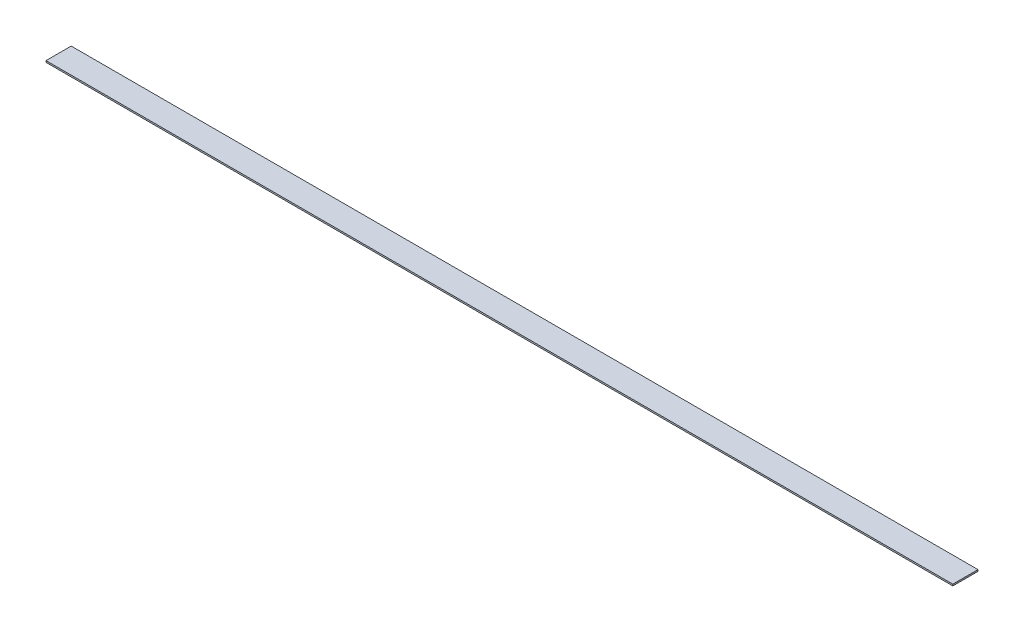
ISO-10303-21;
HEADER;
FILE_DESCRIPTION(('STEP AP214'),'2;1');
FILE_NAME('part.step','',(''),(''),'','','');
FILE_SCHEMA(('AUTOMOTIVE_DESIGN { 1 0 10303 214 1 1 1 1 }'));
ENDSEC;
DATA;
#1=APPLICATION_CONTEXT('core data for automotive mechanical design processes');
#2=APPLICATION_PROTOCOL_DEFINITION('international standard','automotive_design',2000,#1);
#3=PRODUCT_CONTEXT('',#1,'mechanical');
#4=PRODUCT('Part','Part','',(#3));
#5=PRODUCT_RELATED_PRODUCT_CATEGORY('part','',(#4));
#6=PRODUCT_DEFINITION_FORMATION('','',#4);
#7=PRODUCT_DEFINITION_CONTEXT('part definition',#1,'design');
#8=PRODUCT_DEFINITION('design','',#6,#7);
#9=PRODUCT_DEFINITION_SHAPE('','',#8);
#10=(LENGTH_UNIT() NAMED_UNIT(*) SI_UNIT(.MILLI.,.METRE.));
#11=(NAMED_UNIT(*) PLANE_ANGLE_UNIT() SI_UNIT($,.RADIAN.));
#12=(NAMED_UNIT(*) SI_UNIT($,.STERADIAN.) SOLID_ANGLE_UNIT());
#13=UNCERTAINTY_MEASURE_WITH_UNIT(LENGTH_MEASURE(1.E-05),#10,'distance_accuracy_value','');
#14=(GEOMETRIC_REPRESENTATION_CONTEXT(3) GLOBAL_UNCERTAINTY_ASSIGNED_CONTEXT((#13)) GLOBAL_UNIT_ASSIGNED_CONTEXT((#10,
#11,#12)) REPRESENTATION_CONTEXT('',''));
#15=CARTESIAN_POINT('',(0.,0.,0.));
#16=DIRECTION('',(0.,0.,1.));
#17=DIRECTION('',(1.,0.,0.));
#18=AXIS2_PLACEMENT_3D('',#15,#16,#17);
#19=CARTESIAN_POINT('',(0.,1.5875,0.));
#20=DIRECTION('',(1.,0.,0.));
#21=DIRECTION('',(0.,0.,-1.));
#22=AXIS2_PLACEMENT_3D('',#19,#20,#21);
#23=PLANE('',#22);
#24=DIRECTION('',(0.,0.,1.));
#25=VECTOR('',#24,1.);
#26=CARTESIAN_POINT('',(0.,0.,0.));
#27=LINE('',#26,#25);
#28=CARTESIAN_POINT('',(0.,0.,-25.4));
#29=VERTEX_POINT('',#28);
#30=CARTESIAN_POINT('',(0.,0.,0.));
#31=VERTEX_POINT('',#30);
#32=EDGE_CURVE('E98',#29,#31,#27,.T.);
#33=ORIENTED_EDGE('',*,*,#32,.T.);
#34=DIRECTION('',(0.,-1.,0.));
#35=VECTOR('',#34,1.);
#36=CARTESIAN_POINT('',(0.,1.5875,0.));
#37=LINE('',#36,#35);
#38=CARTESIAN_POINT('',(0.,1.5875,0.));
#39=VERTEX_POINT('',#38);
#40=EDGE_CURVE('E11',#39,#31,#37,.T.);
#41=ORIENTED_EDGE('',*,*,#40,.F.);
#42=DIRECTION('',(0.,0.,1.));
#43=VECTOR('',#42,1.);
#44=CARTESIAN_POINT('',(0.,1.5875,0.));
#45=LINE('',#44,#43);
#46=CARTESIAN_POINT('',(0.,1.5875,-25.4));
#47=VERTEX_POINT('',#46);
#48=EDGE_CURVE('E86',#47,#39,#45,.T.);
#49=ORIENTED_EDGE('',*,*,#48,.F.);
#50=DIRECTION('',(0.,-1.,0.));
#51=VECTOR('',#50,1.);
#52=CARTESIAN_POINT('',(0.,1.5875,-25.4));
#53=LINE('',#52,#51);
#54=EDGE_CURVE('E94',#47,#29,#53,.T.);
#55=ORIENTED_EDGE('',*,*,#54,.T.);
#56=EDGE_LOOP('',(#33,#41,#49,#55));
#57=FACE_BOUND('',#56,.T.);
#58=ADVANCED_FACE('F35',(#57),#23,.F.);
#59=CARTESIAN_POINT('',(0.,1.5875,0.));
#60=DIRECTION('',(0.,0.,-1.));
#61=DIRECTION('',(-1.,0.,0.));
#62=AXIS2_PLACEMENT_3D('',#59,#60,#61);
#63=PLANE('',#62);
#64=DIRECTION('',(1.,0.,0.));
#65=VECTOR('',#64,1.);
#66=CARTESIAN_POINT('',(0.,0.,0.));
#67=LINE('',#66,#65);
#68=CARTESIAN_POINT('',(914.4,0.,0.));
#69=VERTEX_POINT('',#68);
#70=EDGE_CURVE('E90',#31,#69,#67,.T.);
#71=ORIENTED_EDGE('',*,*,#70,.T.);
#72=DIRECTION('',(0.,-1.,0.));
#73=VECTOR('',#72,1.);
#74=CARTESIAN_POINT('',(914.4,1.5875,0.));
#75=LINE('',#74,#73);
#76=CARTESIAN_POINT('',(914.4,1.5875,0.));
#77=VERTEX_POINT('',#76);
#78=EDGE_CURVE('E43',#77,#69,#75,.T.);
#79=ORIENTED_EDGE('',*,*,#78,.F.);
#80=DIRECTION('',(1.,0.,0.));
#81=VECTOR('',#80,1.);
#82=CARTESIAN_POINT('',(0.,1.5875,0.));
#83=LINE('',#82,#81);
#84=EDGE_CURVE('E81',#39,#77,#83,.T.);
#85=ORIENTED_EDGE('',*,*,#84,.F.);
#86=ORIENTED_EDGE('',*,*,#40,.T.);
#87=EDGE_LOOP('',(#71,#79,#85,#86));
#88=FACE_BOUND('',#87,.T.);
#89=ADVANCED_FACE('F89',(#88),#63,.F.);
#90=CARTESIAN_POINT('',(914.4,1.5875,0.));
#91=DIRECTION('',(-1.,0.,0.));
#92=DIRECTION('',(0.,0.,1.));
#93=AXIS2_PLACEMENT_3D('',#90,#91,#92);
#94=PLANE('',#93);
#95=DIRECTION('',(0.,0.,-1.));
#96=VECTOR('',#95,1.);
#97=CARTESIAN_POINT('',(914.4,0.,0.));
#98=LINE('',#97,#96);
#99=CARTESIAN_POINT('',(914.4,0.,-25.4));
#100=VERTEX_POINT('',#99);
#101=EDGE_CURVE('E68',#69,#100,#98,.T.);
#102=ORIENTED_EDGE('',*,*,#101,.T.);
#103=DIRECTION('',(0.,-1.,0.));
#104=VECTOR('',#103,1.);
#105=CARTESIAN_POINT('',(914.4,1.5875,-25.4));
#106=LINE('',#105,#104);
#107=CARTESIAN_POINT('',(914.4,1.5875,-25.4));
#108=VERTEX_POINT('',#107);
#109=EDGE_CURVE('E91',#108,#100,#106,.T.);
#110=ORIENTED_EDGE('',*,*,#109,.F.);
#111=DIRECTION('',(0.,0.,-1.));
#112=VECTOR('',#111,1.);
#113=CARTESIAN_POINT('',(914.4,1.5875,0.));
#114=LINE('',#113,#112);
#115=EDGE_CURVE('E84',#77,#108,#114,.T.);
#116=ORIENTED_EDGE('',*,*,#115,.F.);
#117=ORIENTED_EDGE('',*,*,#78,.T.);
#118=EDGE_LOOP('',(#102,#110,#116,#117));
#119=FACE_BOUND('',#118,.T.);
#120=ADVANCED_FACE('F92',(#119),#94,.F.);
#121=CARTESIAN_POINT('',(0.,1.5875,-25.4));
#122=DIRECTION('',(0.,0.,1.));
#123=DIRECTION('',(1.,0.,0.));
#124=AXIS2_PLACEMENT_3D('',#121,#122,#123);
#125=PLANE('',#124);
#126=DIRECTION('',(-1.,0.,0.));
#127=VECTOR('',#126,1.);
#128=CARTESIAN_POINT('',(0.,0.,-25.4));
#129=LINE('',#128,#127);
#130=EDGE_CURVE('E74',#100,#29,#129,.T.);
#131=ORIENTED_EDGE('',*,*,#130,.T.);
#132=ORIENTED_EDGE('',*,*,#54,.F.);
#133=DIRECTION('',(-1.,0.,0.));
#134=VECTOR('',#133,1.);
#135=CARTESIAN_POINT('',(0.,1.5875,-25.4));
#136=LINE('',#135,#134);
#137=EDGE_CURVE('E51',#108,#47,#136,.T.);
#138=ORIENTED_EDGE('',*,*,#137,.F.);
#139=ORIENTED_EDGE('',*,*,#109,.T.);
#140=EDGE_LOOP('',(#131,#132,#138,#139));
#141=FACE_BOUND('',#140,.T.);
#142=ADVANCED_FACE('F105',(#141),#125,.F.);
#143=CARTESIAN_POINT('',(0.,1.5875,0.));
#144=DIRECTION('',(0.,-1.,0.));
#145=DIRECTION('',(0.,0.,-1.));
#146=AXIS2_PLACEMENT_3D('',#143,#144,#145);
#147=PLANE('',#146);
#148=ORIENTED_EDGE('',*,*,#48,.T.);
#149=ORIENTED_EDGE('',*,*,#84,.T.);
#150=ORIENTED_EDGE('',*,*,#115,.T.);
#151=ORIENTED_EDGE('',*,*,#137,.T.);
#152=EDGE_LOOP('',(#148,#149,#150,#151));
#153=FACE_BOUND('',#152,.T.);
#154=ADVANCED_FACE('F82',(#153),#147,.F.);
#155=CARTESIAN_POINT('',(0.,0.,0.));
#156=DIRECTION('',(0.,-1.,0.));
#157=DIRECTION('',(0.,0.,-1.));
#158=AXIS2_PLACEMENT_3D('',#155,#156,#157);
#159=PLANE('',#158);
#160=ORIENTED_EDGE('',*,*,#32,.F.);
#161=ORIENTED_EDGE('',*,*,#130,.F.);
#162=ORIENTED_EDGE('',*,*,#101,.F.);
#163=ORIENTED_EDGE('',*,*,#70,.F.);
#164=EDGE_LOOP('',(#160,#161,#162,#163));
#165=FACE_BOUND('',#164,.T.);
#166=ADVANCED_FACE('F108',(#165),#159,.T.);
#167=CLOSED_SHELL('',(#58,#89,#120,#142,#154,#166));
#168=MANIFOLD_SOLID_BREP('B2',#167);
#169=ADVANCED_BREP_SHAPE_REPRESENTATION('',(#18,#168),#14);
#170=SHAPE_DEFINITION_REPRESENTATION(#9,#169);
ENDSEC;
END-ISO-10303-21;
